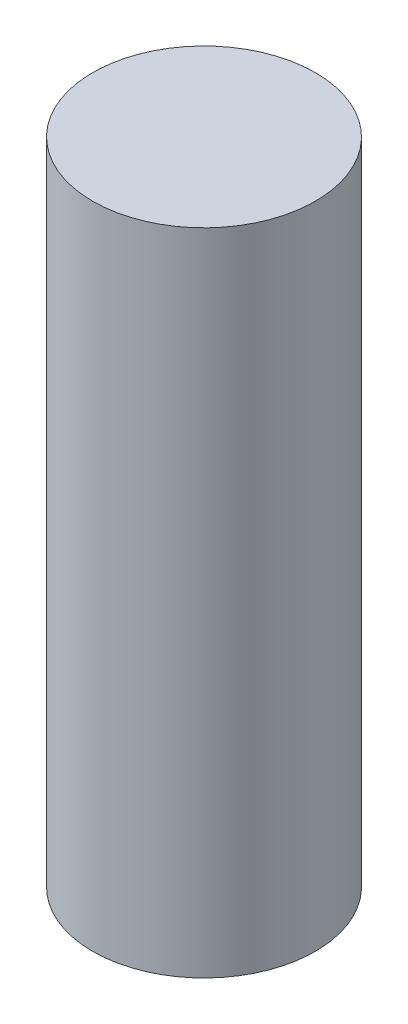
ISO-10303-21;
HEADER;
FILE_DESCRIPTION(('STEP AP214'),'2;1');
FILE_NAME('part.step','',(''),(''),'','','');
FILE_SCHEMA(('AUTOMOTIVE_DESIGN { 1 0 10303 214 1 1 1 1 }'));
ENDSEC;
DATA;
#1=APPLICATION_CONTEXT('core data for automotive mechanical design processes');
#2=APPLICATION_PROTOCOL_DEFINITION('international standard','automotive_design',2000,#1);
#3=PRODUCT_CONTEXT('',#1,'mechanical');
#4=PRODUCT('Part','Part','',(#3));
#5=PRODUCT_RELATED_PRODUCT_CATEGORY('part','',(#4));
#6=PRODUCT_DEFINITION_FORMATION('','',#4);
#7=PRODUCT_DEFINITION_CONTEXT('part definition',#1,'design');
#8=PRODUCT_DEFINITION('design','',#6,#7);
#9=PRODUCT_DEFINITION_SHAPE('','',#8);
#10=(LENGTH_UNIT() NAMED_UNIT(*) SI_UNIT(.MILLI.,.METRE.));
#11=(NAMED_UNIT(*) PLANE_ANGLE_UNIT() SI_UNIT($,.RADIAN.));
#12=(NAMED_UNIT(*) SI_UNIT($,.STERADIAN.) SOLID_ANGLE_UNIT());
#13=UNCERTAINTY_MEASURE_WITH_UNIT(LENGTH_MEASURE(1.E-05),#10,'distance_accuracy_value','');
#14=(GEOMETRIC_REPRESENTATION_CONTEXT(3) GLOBAL_UNCERTAINTY_ASSIGNED_CONTEXT((#13)) GLOBAL_UNIT_ASSIGNED_CONTEXT((#10,
#11,#12)) REPRESENTATION_CONTEXT('',''));
#15=CARTESIAN_POINT('',(0.,0.,0.));
#16=DIRECTION('',(0.,0.,1.));
#17=DIRECTION('',(1.,0.,0.));
#18=AXIS2_PLACEMENT_3D('',#15,#16,#17);
#19=CARTESIAN_POINT('',(0.,17.5,0.));
#20=DIRECTION('',(0.,-1.,0.));
#21=DIRECTION('',(0.,0.,-1.));
#22=AXIS2_PLACEMENT_3D('',#19,#20,#21);
#23=CYLINDRICAL_SURFACE('',#22,3.);
#24=CARTESIAN_POINT('',(0.,17.5,0.));
#25=DIRECTION('',(0.,1.,0.));
#26=DIRECTION('',(0.,0.,1.));
#27=AXIS2_PLACEMENT_3D('',#24,#25,#26);
#28=CIRCLE('',#27,3.);
#29=CARTESIAN_POINT('',(0.,17.5,3.));
#30=VERTEX_POINT('',#29);
#31=EDGE_CURVE('E10',#30,#30,#28,.T.);
#32=ORIENTED_EDGE('',*,*,#31,.F.);
#33=EDGE_LOOP('',(#32));
#34=FACE_BOUND('',#33,.T.);
#35=CARTESIAN_POINT('',(0.,0.,0.));
#36=DIRECTION('',(0.,1.,0.));
#37=DIRECTION('',(0.,0.,1.));
#38=AXIS2_PLACEMENT_3D('',#35,#36,#37);
#39=CIRCLE('',#38,3.);
#40=CARTESIAN_POINT('',(0.,0.,3.));
#41=VERTEX_POINT('',#40);
#42=EDGE_CURVE('E40',#41,#41,#39,.T.);
#43=ORIENTED_EDGE('',*,*,#42,.T.);
#44=EDGE_LOOP('',(#43));
#45=FACE_BOUND('',#44,.T.);
#46=ADVANCED_FACE('F37',(#34,#45),#23,.T.);
#47=CARTESIAN_POINT('',(0.,17.5,0.));
#48=DIRECTION('',(0.,1.,0.));
#49=DIRECTION('',(0.,0.,1.));
#50=AXIS2_PLACEMENT_3D('',#47,#48,#49);
#51=PLANE('',#50);
#52=ORIENTED_EDGE('',*,*,#31,.T.);
#53=EDGE_LOOP('',(#52));
#54=FACE_BOUND('',#53,.T.);
#55=ADVANCED_FACE('F54',(#54),#51,.T.);
#56=CARTESIAN_POINT('',(0.,0.,0.));
#57=DIRECTION('',(0.,1.,0.));
#58=DIRECTION('',(0.,0.,1.));
#59=AXIS2_PLACEMENT_3D('',#56,#57,#58);
#60=PLANE('',#59);
#61=ORIENTED_EDGE('',*,*,#42,.F.);
#62=EDGE_LOOP('',(#61));
#63=FACE_BOUND('',#62,.T.);
#64=ADVANCED_FACE('F52',(#63),#60,.F.);
#65=CLOSED_SHELL('',(#46,#55,#64));
#66=MANIFOLD_SOLID_BREP('B2',#65);
#67=ADVANCED_BREP_SHAPE_REPRESENTATION('',(#18,#66),#14);
#68=SHAPE_DEFINITION_REPRESENTATION(#9,#67);
ENDSEC;
END-ISO-10303-21;
